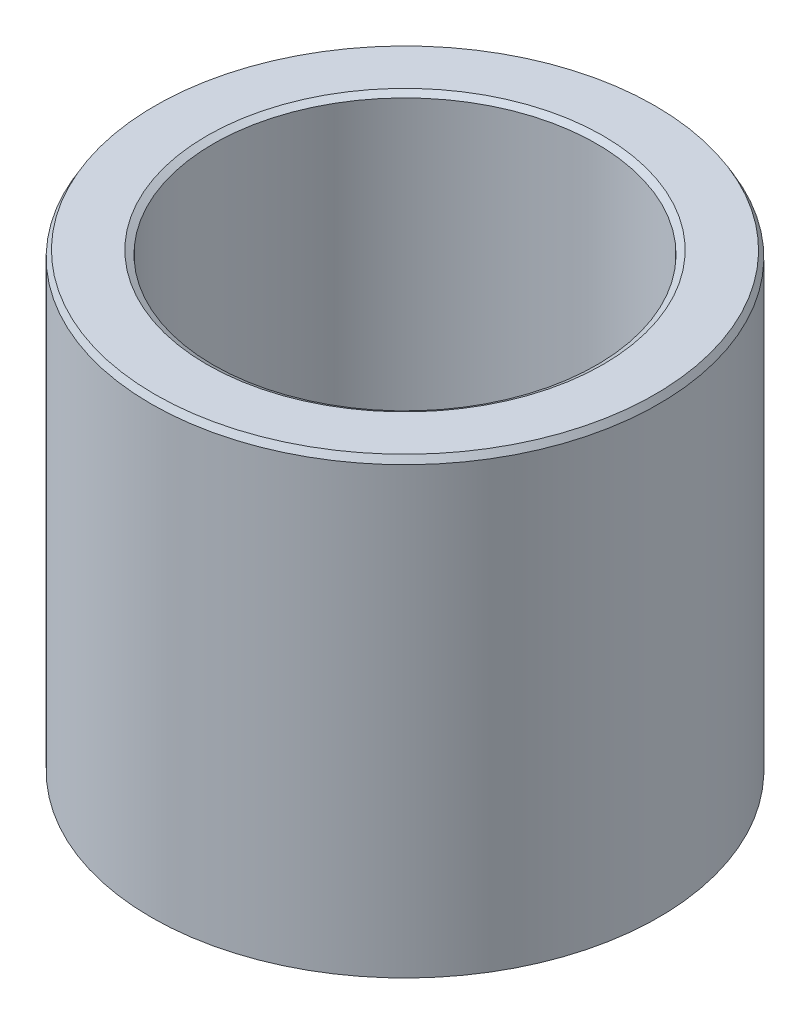
ISO-10303-21;
HEADER;
FILE_DESCRIPTION(('STEP AP214'),'2;1');
FILE_NAME('part.step','',(''),(''),'','','');
FILE_SCHEMA(('AUTOMOTIVE_DESIGN { 1 0 10303 214 1 1 1 1 }'));
ENDSEC;
DATA;
#1=APPLICATION_CONTEXT('core data for automotive mechanical design processes');
#2=APPLICATION_PROTOCOL_DEFINITION('international standard','automotive_design',2000,#1);
#3=PRODUCT_CONTEXT('',#1,'mechanical');
#4=PRODUCT('Part','Part','',(#3));
#5=PRODUCT_RELATED_PRODUCT_CATEGORY('part','',(#4));
#6=PRODUCT_DEFINITION_FORMATION('','',#4);
#7=PRODUCT_DEFINITION_CONTEXT('part definition',#1,'design');
#8=PRODUCT_DEFINITION('design','',#6,#7);
#9=PRODUCT_DEFINITION_SHAPE('','',#8);
#10=(LENGTH_UNIT() NAMED_UNIT(*) SI_UNIT(.MILLI.,.METRE.));
#11=(NAMED_UNIT(*) PLANE_ANGLE_UNIT() SI_UNIT($,.RADIAN.));
#12=(NAMED_UNIT(*) SI_UNIT($,.STERADIAN.) SOLID_ANGLE_UNIT());
#13=UNCERTAINTY_MEASURE_WITH_UNIT(LENGTH_MEASURE(1.E-05),#10,'distance_accuracy_value','');
#14=(GEOMETRIC_REPRESENTATION_CONTEXT(3) GLOBAL_UNCERTAINTY_ASSIGNED_CONTEXT((#13)) GLOBAL_UNIT_ASSIGNED_CONTEXT((#10,
#11,#12)) REPRESENTATION_CONTEXT('',''));
#15=CARTESIAN_POINT('',(0.,0.,0.));
#16=DIRECTION('',(0.,0.,1.));
#17=DIRECTION('',(1.,0.,0.));
#18=AXIS2_PLACEMENT_3D('',#15,#16,#17);
#19=CARTESIAN_POINT('',(0.,71.6781461195148,0.));
#20=DIRECTION('',(0.,-1.,0.));
#21=DIRECTION('',(0.,0.,-1.));
#22=AXIS2_PLACEMENT_3D('',#19,#20,#21);
#23=CYLINDRICAL_SURFACE('',#22,40.);
#24=CARTESIAN_POINT('',(0.,0.586142282407817,0.));
#25=DIRECTION('',(0.,1.,0.));
#26=DIRECTION('',(0.,0.,1.));
#27=AXIS2_PLACEMENT_3D('',#24,#25,#26);
#28=CIRCLE('',#27,40.);
#29=CARTESIAN_POINT('',(0.,0.586142282407817,40.));
#30=VERTEX_POINT('',#29);
#31=EDGE_CURVE('E10',#30,#30,#28,.T.);
#32=ORIENTED_EDGE('',*,*,#31,.T.);
#33=EDGE_LOOP('',(#32));
#34=FACE_BOUND('',#33,.T.);
#35=CARTESIAN_POINT('',(0.,70.66291790592,0.));
#36=DIRECTION('',(0.,1.,0.));
#37=DIRECTION('',(0.,0.,1.));
#38=AXIS2_PLACEMENT_3D('',#35,#36,#37);
#39=CIRCLE('',#38,40.);
#40=CARTESIAN_POINT('',(0.,70.66291790592,40.));
#41=VERTEX_POINT('',#40);
#42=EDGE_CURVE('E50',#41,#41,#39,.F.);
#43=ORIENTED_EDGE('',*,*,#42,.T.);
#44=EDGE_LOOP('',(#43));
#45=FACE_BOUND('',#44,.T.);
#46=ADVANCED_FACE('F39',(#34,#45),#23,.T.);
#47=CARTESIAN_POINT('',(0.,71.6781461195148,0.));
#48=DIRECTION('',(0.,1.,0.));
#49=DIRECTION('',(0.,0.,1.));
#50=AXIS2_PLACEMENT_3D('',#47,#48,#49);
#51=PLANE('',#50);
#52=CARTESIAN_POINT('',(0.,71.6781461195148,0.));
#53=DIRECTION('',(0.,1.,0.));
#54=DIRECTION('',(0.,0.,1.));
#55=AXIS2_PLACEMENT_3D('',#52,#53,#54);
#56=CIRCLE('',#55,31.2304354270306);
#57=CARTESIAN_POINT('',(0.,71.6781461195148,31.2304354270306));
#58=VERTEX_POINT('',#57);
#59=EDGE_CURVE('E58',#58,#58,#56,.F.);
#60=ORIENTED_EDGE('',*,*,#59,.T.);
#61=EDGE_LOOP('',(#60));
#62=FACE_BOUND('',#61,.T.);
#63=CARTESIAN_POINT('',(0.,71.6781461195148,0.));
#64=DIRECTION('',(0.,1.,0.));
#65=DIRECTION('',(0.,0.,1.));
#66=AXIS2_PLACEMENT_3D('',#63,#64,#65);
#67=CIRCLE('',#66,39.4138577175922);
#68=CARTESIAN_POINT('',(0.,71.6781461195148,39.4138577175922));
#69=VERTEX_POINT('',#68);
#70=EDGE_CURVE('E61',#69,#69,#67,.T.);
#71=ORIENTED_EDGE('',*,*,#70,.T.);
#72=EDGE_LOOP('',(#71));
#73=FACE_BOUND('',#72,.T.);
#74=ADVANCED_FACE('F88',(#62,#73),#51,.T.);
#75=CARTESIAN_POINT('',(0.,0.,0.));
#76=DIRECTION('',(0.,1.,0.));
#77=DIRECTION('',(0.,0.,1.));
#78=AXIS2_PLACEMENT_3D('',#75,#76,#77);
#79=PLANE('',#78);
#80=CARTESIAN_POINT('',(0.,0.,0.));
#81=DIRECTION('',(0.,1.,0.));
#82=DIRECTION('',(0.,0.,1.));
#83=AXIS2_PLACEMENT_3D('',#80,#81,#82);
#84=CIRCLE('',#83,30.8013494958437);
#85=CARTESIAN_POINT('',(0.,0.,30.8013494958437));
#86=VERTEX_POINT('',#85);
#87=EDGE_CURVE('E51',#86,#86,#84,.T.);
#88=ORIENTED_EDGE('',*,*,#87,.T.);
#89=EDGE_LOOP('',(#88));
#90=FACE_BOUND('',#89,.T.);
#91=CARTESIAN_POINT('',(0.,0.,0.));
#92=DIRECTION('',(0.,1.,0.));
#93=DIRECTION('',(0.,0.,1.));
#94=AXIS2_PLACEMENT_3D('',#91,#92,#93);
#95=CIRCLE('',#94,38.9847717864053);
#96=CARTESIAN_POINT('',(0.,0.,38.9847717864053));
#97=VERTEX_POINT('',#96);
#98=EDGE_CURVE('E54',#97,#97,#95,.F.);
#99=ORIENTED_EDGE('',*,*,#98,.T.);
#100=EDGE_LOOP('',(#99));
#101=FACE_BOUND('',#100,.T.);
#102=ADVANCED_FACE('F83',(#90,#101),#79,.F.);
#103=CARTESIAN_POINT('',(0.,71.6781461195148,0.));
#104=DIRECTION('',(0.,-1.,0.));
#105=DIRECTION('',(0.,0.,-1.));
#106=AXIS2_PLACEMENT_3D('',#103,#104,#105);
#107=CYLINDRICAL_SURFACE('',#106,30.2152072134359);
#108=CARTESIAN_POINT('',(0.,71.0920038371069,0.));
#109=DIRECTION('',(0.,1.,0.));
#110=DIRECTION('',(0.,0.,1.));
#111=AXIS2_PLACEMENT_3D('',#108,#109,#110);
#112=CIRCLE('',#111,30.2152072134359);
#113=CARTESIAN_POINT('',(0.,71.0920038371069,30.2152072134359));
#114=VERTEX_POINT('',#113);
#115=EDGE_CURVE('E67',#114,#114,#112,.T.);
#116=ORIENTED_EDGE('',*,*,#115,.T.);
#117=EDGE_LOOP('',(#116));
#118=FACE_BOUND('',#117,.T.);
#119=CARTESIAN_POINT('',(0.,1.01522821359475,0.));
#120=DIRECTION('',(0.,1.,0.));
#121=DIRECTION('',(0.,0.,1.));
#122=AXIS2_PLACEMENT_3D('',#119,#120,#121);
#123=CIRCLE('',#122,30.2152072134359);
#124=CARTESIAN_POINT('',(0.,1.01522821359475,30.2152072134359));
#125=VERTEX_POINT('',#124);
#126=EDGE_CURVE('E69',#125,#125,#123,.F.);
#127=ORIENTED_EDGE('',*,*,#126,.T.);
#128=EDGE_LOOP('',(#127));
#129=FACE_BOUND('',#128,.T.);
#130=ADVANCED_FACE('F71',(#118,#129),#107,.F.);
#131=CARTESIAN_POINT('',(0.,71.0920038371069,0.));
#132=DIRECTION('',(0.,1.,0.));
#133=DIRECTION('',(0.,0.,1.));
#134=AXIS2_PLACEMENT_3D('',#131,#132,#133);
#135=CONICAL_SURFACE('',#134,30.2152072134359,1.0471975511966);
#136=ORIENTED_EDGE('',*,*,#59,.F.);
#137=EDGE_LOOP('',(#136));
#138=FACE_BOUND('',#137,.T.);
#139=ORIENTED_EDGE('',*,*,#115,.F.);
#140=EDGE_LOOP('',(#139));
#141=FACE_BOUND('',#140,.T.);
#142=ADVANCED_FACE('F77',(#138,#141),#135,.F.);
#143=CARTESIAN_POINT('',(0.,0.,0.));
#144=DIRECTION('',(0.,-1.,0.));
#145=DIRECTION('',(0.,0.,-1.));
#146=AXIS2_PLACEMENT_3D('',#143,#144,#145);
#147=CONICAL_SURFACE('',#146,30.8013494958437,0.523598775598292);
#148=ORIENTED_EDGE('',*,*,#126,.F.);
#149=EDGE_LOOP('',(#148));
#150=FACE_BOUND('',#149,.T.);
#151=ORIENTED_EDGE('',*,*,#87,.F.);
#152=EDGE_LOOP('',(#151));
#153=FACE_BOUND('',#152,.T.);
#154=ADVANCED_FACE('F73',(#150,#153),#147,.F.);
#155=CARTESIAN_POINT('',(0.,0.586142282407817,0.));
#156=DIRECTION('',(0.,1.,0.));
#157=DIRECTION('',(0.,0.,1.));
#158=AXIS2_PLACEMENT_3D('',#155,#156,#157);
#159=CONICAL_SURFACE('',#158,40.,1.0471975511966);
#160=ORIENTED_EDGE('',*,*,#98,.F.);
#161=EDGE_LOOP('',(#160));
#162=FACE_BOUND('',#161,.T.);
#163=ORIENTED_EDGE('',*,*,#31,.F.);
#164=EDGE_LOOP('',(#163));
#165=FACE_BOUND('',#164,.T.);
#166=ADVANCED_FACE('F76',(#162,#165),#159,.T.);
#167=CARTESIAN_POINT('',(0.,71.6781461195148,0.));
#168=DIRECTION('',(0.,-1.,0.));
#169=DIRECTION('',(0.,0.,-1.));
#170=AXIS2_PLACEMENT_3D('',#167,#168,#169);
#171=CONICAL_SURFACE('',#170,39.4138577175922,0.523598775598289);
#172=ORIENTED_EDGE('',*,*,#42,.F.);
#173=EDGE_LOOP('',(#172));
#174=FACE_BOUND('',#173,.T.);
#175=ORIENTED_EDGE('',*,*,#70,.F.);
#176=EDGE_LOOP('',(#175));
#177=FACE_BOUND('',#176,.T.);
#178=ADVANCED_FACE('F45',(#174,#177),#171,.T.);
#179=CLOSED_SHELL('',(#46,#74,#102,#130,#142,#154,#166,#178));
#180=MANIFOLD_SOLID_BREP('B2',#179);
#181=ADVANCED_BREP_SHAPE_REPRESENTATION('',(#18,#180),#14);
#182=SHAPE_DEFINITION_REPRESENTATION(#9,#181);
ENDSEC;
END-ISO-10303-21;
